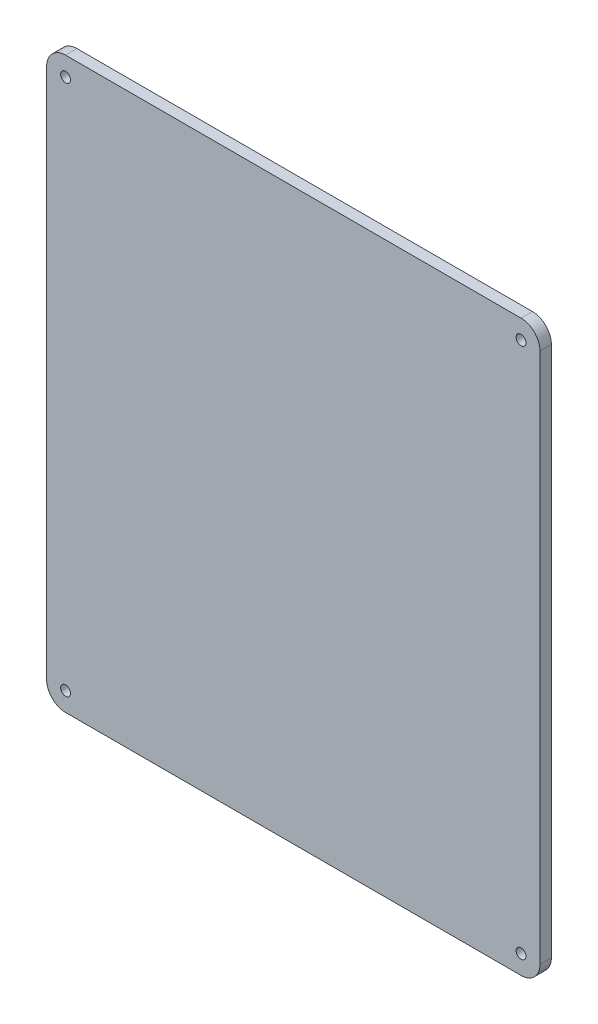
ISO-10303-21;
HEADER;
FILE_DESCRIPTION(('STEP AP214'),'2;1');
FILE_NAME('part.step','',(''),(''),'','','');
FILE_SCHEMA(('AUTOMOTIVE_DESIGN { 1 0 10303 214 1 1 1 1 }'));
ENDSEC;
DATA;
#1=APPLICATION_CONTEXT('core data for automotive mechanical design processes');
#2=APPLICATION_PROTOCOL_DEFINITION('international standard','automotive_design',2000,#1);
#3=PRODUCT_CONTEXT('',#1,'mechanical');
#4=PRODUCT('Part','Part','',(#3));
#5=PRODUCT_RELATED_PRODUCT_CATEGORY('part','',(#4));
#6=PRODUCT_DEFINITION_FORMATION('','',#4);
#7=PRODUCT_DEFINITION_CONTEXT('part definition',#1,'design');
#8=PRODUCT_DEFINITION('design','',#6,#7);
#9=PRODUCT_DEFINITION_SHAPE('','',#8);
#10=(LENGTH_UNIT() NAMED_UNIT(*) SI_UNIT(.MILLI.,.METRE.));
#11=(NAMED_UNIT(*) PLANE_ANGLE_UNIT() SI_UNIT($,.RADIAN.));
#12=(NAMED_UNIT(*) SI_UNIT($,.STERADIAN.) SOLID_ANGLE_UNIT());
#13=UNCERTAINTY_MEASURE_WITH_UNIT(LENGTH_MEASURE(1.E-05),#10,'distance_accuracy_value','');
#14=(GEOMETRIC_REPRESENTATION_CONTEXT(3) GLOBAL_UNCERTAINTY_ASSIGNED_CONTEXT((#13)) GLOBAL_UNIT_ASSIGNED_CONTEXT((#10,
#11,#12)) REPRESENTATION_CONTEXT('',''));
#15=CARTESIAN_POINT('',(0.,0.,0.));
#16=DIRECTION('',(0.,0.,1.));
#17=DIRECTION('',(1.,0.,0.));
#18=AXIS2_PLACEMENT_3D('',#15,#16,#17);
#19=CARTESIAN_POINT('',(-60.,-70.,3.));
#20=DIRECTION('',(0.,0.,-1.));
#21=DIRECTION('',(-1.,0.,0.));
#22=AXIS2_PLACEMENT_3D('',#19,#20,#21);
#23=CYLINDRICAL_SURFACE('',#22,5.);
#24=CARTESIAN_POINT('',(-60.,-70.,0.));
#25=DIRECTION('',(0.,0.,1.));
#26=DIRECTION('',(1.,0.,0.));
#27=AXIS2_PLACEMENT_3D('',#24,#25,#26);
#28=CIRCLE('',#27,5.);
#29=CARTESIAN_POINT('',(-65.,-70.,0.));
#30=VERTEX_POINT('',#29);
#31=CARTESIAN_POINT('',(-60.,-75.,0.));
#32=VERTEX_POINT('',#31);
#33=EDGE_CURVE('E129',#30,#32,#28,.T.);
#34=ORIENTED_EDGE('',*,*,#33,.T.);
#35=DIRECTION('',(0.,0.,-1.));
#36=VECTOR('',#35,1.);
#37=CARTESIAN_POINT('',(-60.,-75.,3.));
#38=LINE('',#37,#36);
#39=CARTESIAN_POINT('',(-60.,-75.,3.));
#40=VERTEX_POINT('',#39);
#41=EDGE_CURVE('E11',#40,#32,#38,.T.);
#42=ORIENTED_EDGE('',*,*,#41,.F.);
#43=CARTESIAN_POINT('',(-60.,-70.,3.));
#44=DIRECTION('',(0.,0.,1.));
#45=DIRECTION('',(1.,0.,0.));
#46=AXIS2_PLACEMENT_3D('',#43,#44,#45);
#47=CIRCLE('',#46,5.);
#48=CARTESIAN_POINT('',(-65.,-70.,3.));
#49=VERTEX_POINT('',#48);
#50=EDGE_CURVE('E144',#49,#40,#47,.T.);
#51=ORIENTED_EDGE('',*,*,#50,.F.);
#52=DIRECTION('',(0.,0.,-1.));
#53=VECTOR('',#52,1.);
#54=CARTESIAN_POINT('',(-65.,-70.,3.));
#55=LINE('',#54,#53);
#56=EDGE_CURVE('E125',#49,#30,#55,.T.);
#57=ORIENTED_EDGE('',*,*,#56,.T.);
#58=EDGE_LOOP('',(#34,#42,#51,#57));
#59=FACE_BOUND('',#58,.T.);
#60=ADVANCED_FACE('F33',(#59),#23,.T.);
#61=CARTESIAN_POINT('',(-60.,-75.,3.));
#62=DIRECTION('',(0.,1.,0.));
#63=DIRECTION('',(0.,0.,1.));
#64=AXIS2_PLACEMENT_3D('',#61,#62,#63);
#65=PLANE('',#64);
#66=DIRECTION('',(1.,0.,0.));
#67=VECTOR('',#66,1.);
#68=CARTESIAN_POINT('',(-60.,-75.,0.));
#69=LINE('',#68,#67);
#70=CARTESIAN_POINT('',(60.,-75.,0.));
#71=VERTEX_POINT('',#70);
#72=EDGE_CURVE('E132',#32,#71,#69,.T.);
#73=ORIENTED_EDGE('',*,*,#72,.T.);
#74=DIRECTION('',(0.,0.,-1.));
#75=VECTOR('',#74,1.);
#76=CARTESIAN_POINT('',(60.,-75.,3.));
#77=LINE('',#76,#75);
#78=CARTESIAN_POINT('',(60.,-75.,3.));
#79=VERTEX_POINT('',#78);
#80=EDGE_CURVE('E41',#79,#71,#77,.T.);
#81=ORIENTED_EDGE('',*,*,#80,.F.);
#82=DIRECTION('',(1.,0.,0.));
#83=VECTOR('',#82,1.);
#84=CARTESIAN_POINT('',(-60.,-75.,3.));
#85=LINE('',#84,#83);
#86=EDGE_CURVE('E92',#40,#79,#85,.T.);
#87=ORIENTED_EDGE('',*,*,#86,.F.);
#88=ORIENTED_EDGE('',*,*,#41,.T.);
#89=EDGE_LOOP('',(#73,#81,#87,#88));
#90=FACE_BOUND('',#89,.T.);
#91=ADVANCED_FACE('F229',(#90),#65,.F.);
#92=CARTESIAN_POINT('',(60.,-70.,3.));
#93=DIRECTION('',(0.,0.,-1.));
#94=DIRECTION('',(-1.,0.,0.));
#95=AXIS2_PLACEMENT_3D('',#92,#93,#94);
#96=CYLINDRICAL_SURFACE('',#95,5.);
#97=CARTESIAN_POINT('',(60.,-70.,0.));
#98=DIRECTION('',(0.,0.,1.));
#99=DIRECTION('',(1.,0.,0.));
#100=AXIS2_PLACEMENT_3D('',#97,#98,#99);
#101=CIRCLE('',#100,5.);
#102=CARTESIAN_POINT('',(65.,-70.,0.));
#103=VERTEX_POINT('',#102);
#104=EDGE_CURVE('E135',#71,#103,#101,.T.);
#105=ORIENTED_EDGE('',*,*,#104,.T.);
#106=DIRECTION('',(0.,0.,-1.));
#107=VECTOR('',#106,1.);
#108=CARTESIAN_POINT('',(65.,-70.,3.));
#109=LINE('',#108,#107);
#110=CARTESIAN_POINT('',(65.,-70.,3.));
#111=VERTEX_POINT('',#110);
#112=EDGE_CURVE('E151',#111,#103,#109,.T.);
#113=ORIENTED_EDGE('',*,*,#112,.F.);
#114=CARTESIAN_POINT('',(60.,-70.,3.));
#115=DIRECTION('',(0.,0.,1.));
#116=DIRECTION('',(1.,0.,0.));
#117=AXIS2_PLACEMENT_3D('',#114,#115,#116);
#118=CIRCLE('',#117,5.);
#119=EDGE_CURVE('E159',#79,#111,#118,.T.);
#120=ORIENTED_EDGE('',*,*,#119,.F.);
#121=ORIENTED_EDGE('',*,*,#80,.T.);
#122=EDGE_LOOP('',(#105,#113,#120,#121));
#123=FACE_BOUND('',#122,.T.);
#124=ADVANCED_FACE('F157',(#123),#96,.T.);
#125=CARTESIAN_POINT('',(65.,70.,3.));
#126=DIRECTION('',(-1.,0.,0.));
#127=DIRECTION('',(0.,-1.,0.));
#128=AXIS2_PLACEMENT_3D('',#125,#126,#127);
#129=PLANE('',#128);
#130=DIRECTION('',(0.,1.,0.));
#131=VECTOR('',#130,1.);
#132=CARTESIAN_POINT('',(65.,70.,0.));
#133=LINE('',#132,#131);
#134=CARTESIAN_POINT('',(65.,70.,0.));
#135=VERTEX_POINT('',#134);
#136=EDGE_CURVE('E137',#103,#135,#133,.T.);
#137=ORIENTED_EDGE('',*,*,#136,.T.);
#138=DIRECTION('',(0.,0.,-1.));
#139=VECTOR('',#138,1.);
#140=CARTESIAN_POINT('',(65.,70.,3.));
#141=LINE('',#140,#139);
#142=CARTESIAN_POINT('',(65.,70.,3.));
#143=VERTEX_POINT('',#142);
#144=EDGE_CURVE('E148',#143,#135,#141,.T.);
#145=ORIENTED_EDGE('',*,*,#144,.F.);
#146=DIRECTION('',(0.,1.,0.));
#147=VECTOR('',#146,1.);
#148=CARTESIAN_POINT('',(65.,70.,3.));
#149=LINE('',#148,#147);
#150=EDGE_CURVE('E171',#111,#143,#149,.T.);
#151=ORIENTED_EDGE('',*,*,#150,.F.);
#152=ORIENTED_EDGE('',*,*,#112,.T.);
#153=EDGE_LOOP('',(#137,#145,#151,#152));
#154=FACE_BOUND('',#153,.T.);
#155=ADVANCED_FACE('F167',(#154),#129,.F.);
#156=CARTESIAN_POINT('',(60.,70.,3.));
#157=DIRECTION('',(0.,0.,-1.));
#158=DIRECTION('',(-1.,0.,0.));
#159=AXIS2_PLACEMENT_3D('',#156,#157,#158);
#160=CYLINDRICAL_SURFACE('',#159,5.);
#161=CARTESIAN_POINT('',(60.,70.,0.));
#162=DIRECTION('',(0.,0.,1.));
#163=DIRECTION('',(1.,0.,0.));
#164=AXIS2_PLACEMENT_3D('',#161,#162,#163);
#165=CIRCLE('',#164,5.);
#166=CARTESIAN_POINT('',(60.,75.,0.));
#167=VERTEX_POINT('',#166);
#168=EDGE_CURVE('E139',#135,#167,#165,.T.);
#169=ORIENTED_EDGE('',*,*,#168,.T.);
#170=DIRECTION('',(0.,0.,-1.));
#171=VECTOR('',#170,1.);
#172=CARTESIAN_POINT('',(60.,75.,3.));
#173=LINE('',#172,#171);
#174=CARTESIAN_POINT('',(60.,75.,3.));
#175=VERTEX_POINT('',#174);
#176=EDGE_CURVE('E120',#175,#167,#173,.T.);
#177=ORIENTED_EDGE('',*,*,#176,.F.);
#178=CARTESIAN_POINT('',(60.,70.,3.));
#179=DIRECTION('',(0.,0.,1.));
#180=DIRECTION('',(1.,0.,0.));
#181=AXIS2_PLACEMENT_3D('',#178,#179,#180);
#182=CIRCLE('',#181,5.);
#183=EDGE_CURVE('E111',#143,#175,#182,.T.);
#184=ORIENTED_EDGE('',*,*,#183,.F.);
#185=ORIENTED_EDGE('',*,*,#144,.T.);
#186=EDGE_LOOP('',(#169,#177,#184,#185));
#187=FACE_BOUND('',#186,.T.);
#188=ADVANCED_FACE('F170',(#187),#160,.T.);
#189=CARTESIAN_POINT('',(-60.,75.,3.));
#190=DIRECTION('',(0.,-1.,0.));
#191=DIRECTION('',(0.,0.,-1.));
#192=AXIS2_PLACEMENT_3D('',#189,#190,#191);
#193=PLANE('',#192);
#194=DIRECTION('',(-1.,0.,0.));
#195=VECTOR('',#194,1.);
#196=CARTESIAN_POINT('',(-60.,75.,0.));
#197=LINE('',#196,#195);
#198=CARTESIAN_POINT('',(-60.,75.,0.));
#199=VERTEX_POINT('',#198);
#200=EDGE_CURVE('E119',#167,#199,#197,.T.);
#201=ORIENTED_EDGE('',*,*,#200,.T.);
#202=DIRECTION('',(0.,0.,-1.));
#203=VECTOR('',#202,1.);
#204=CARTESIAN_POINT('',(-60.,75.,3.));
#205=LINE('',#204,#203);
#206=CARTESIAN_POINT('',(-60.,75.,3.));
#207=VERTEX_POINT('',#206);
#208=EDGE_CURVE('E116',#207,#199,#205,.T.);
#209=ORIENTED_EDGE('',*,*,#208,.F.);
#210=DIRECTION('',(-1.,0.,0.));
#211=VECTOR('',#210,1.);
#212=CARTESIAN_POINT('',(-60.,75.,3.));
#213=LINE('',#212,#211);
#214=EDGE_CURVE('E105',#175,#207,#213,.T.);
#215=ORIENTED_EDGE('',*,*,#214,.F.);
#216=ORIENTED_EDGE('',*,*,#176,.T.);
#217=EDGE_LOOP('',(#201,#209,#215,#216));
#218=FACE_BOUND('',#217,.T.);
#219=ADVANCED_FACE('F117',(#218),#193,.F.);
#220=CARTESIAN_POINT('',(-60.,70.,3.));
#221=DIRECTION('',(0.,0.,-1.));
#222=DIRECTION('',(-1.,0.,0.));
#223=AXIS2_PLACEMENT_3D('',#220,#221,#222);
#224=CYLINDRICAL_SURFACE('',#223,5.);
#225=CARTESIAN_POINT('',(-60.,70.,0.));
#226=DIRECTION('',(0.,0.,1.));
#227=DIRECTION('',(-1.,0.,0.));
#228=AXIS2_PLACEMENT_3D('',#225,#226,#227);
#229=CIRCLE('',#228,5.);
#230=CARTESIAN_POINT('',(-65.,70.,0.));
#231=VERTEX_POINT('',#230);
#232=EDGE_CURVE('E78',#199,#231,#229,.T.);
#233=ORIENTED_EDGE('',*,*,#232,.T.);
#234=DIRECTION('',(0.,0.,-1.));
#235=VECTOR('',#234,1.);
#236=CARTESIAN_POINT('',(-65.,70.,3.));
#237=LINE('',#236,#235);
#238=CARTESIAN_POINT('',(-65.,70.,3.));
#239=VERTEX_POINT('',#238);
#240=EDGE_CURVE('E121',#239,#231,#237,.T.);
#241=ORIENTED_EDGE('',*,*,#240,.F.);
#242=CARTESIAN_POINT('',(-60.,70.,3.));
#243=DIRECTION('',(0.,0.,1.));
#244=DIRECTION('',(-1.,0.,0.));
#245=AXIS2_PLACEMENT_3D('',#242,#243,#244);
#246=CIRCLE('',#245,5.);
#247=EDGE_CURVE('E109',#207,#239,#246,.T.);
#248=ORIENTED_EDGE('',*,*,#247,.F.);
#249=ORIENTED_EDGE('',*,*,#208,.T.);
#250=EDGE_LOOP('',(#233,#241,#248,#249));
#251=FACE_BOUND('',#250,.T.);
#252=ADVANCED_FACE('F123',(#251),#224,.T.);
#253=CARTESIAN_POINT('',(-65.,70.,3.));
#254=DIRECTION('',(1.,0.,0.));
#255=DIRECTION('',(0.,1.,0.));
#256=AXIS2_PLACEMENT_3D('',#253,#254,#255);
#257=PLANE('',#256);
#258=DIRECTION('',(0.,-1.,0.));
#259=VECTOR('',#258,1.);
#260=CARTESIAN_POINT('',(-65.,70.,0.));
#261=LINE('',#260,#259);
#262=EDGE_CURVE('E84',#231,#30,#261,.T.);
#263=ORIENTED_EDGE('',*,*,#262,.T.);
#264=ORIENTED_EDGE('',*,*,#56,.F.);
#265=DIRECTION('',(0.,-1.,0.));
#266=VECTOR('',#265,1.);
#267=CARTESIAN_POINT('',(-65.,70.,3.));
#268=LINE('',#267,#266);
#269=EDGE_CURVE('E49',#239,#49,#268,.T.);
#270=ORIENTED_EDGE('',*,*,#269,.F.);
#271=ORIENTED_EDGE('',*,*,#240,.T.);
#272=EDGE_LOOP('',(#263,#264,#270,#271));
#273=FACE_BOUND('',#272,.T.);
#274=ADVANCED_FACE('F205',(#273),#257,.F.);
#275=CARTESIAN_POINT('',(-60.,-70.,3.));
#276=DIRECTION('',(0.,0.,1.));
#277=DIRECTION('',(1.,0.,0.));
#278=AXIS2_PLACEMENT_3D('',#275,#276,#277);
#279=PLANE('',#278);
#280=CARTESIAN_POINT('',(-60.,-70.,3.));
#281=DIRECTION('',(0.,0.,1.));
#282=DIRECTION('',(1.,0.,0.));
#283=AXIS2_PLACEMENT_3D('',#280,#281,#282);
#284=CIRCLE('',#283,1.3);
#285=CARTESIAN_POINT('',(-58.7,-70.,3.));
#286=VERTEX_POINT('',#285);
#287=EDGE_CURVE('E192',#286,#286,#284,.T.);
#288=ORIENTED_EDGE('',*,*,#287,.F.);
#289=EDGE_LOOP('',(#288));
#290=FACE_BOUND('',#289,.T.);
#291=CARTESIAN_POINT('',(60.,-70.,3.));
#292=DIRECTION('',(0.,0.,1.));
#293=DIRECTION('',(1.,0.,0.));
#294=AXIS2_PLACEMENT_3D('',#291,#292,#293);
#295=CIRCLE('',#294,1.3);
#296=CARTESIAN_POINT('',(61.3,-70.,3.));
#297=VERTEX_POINT('',#296);
#298=EDGE_CURVE('E186',#297,#297,#295,.T.);
#299=ORIENTED_EDGE('',*,*,#298,.F.);
#300=EDGE_LOOP('',(#299));
#301=FACE_BOUND('',#300,.T.);
#302=CARTESIAN_POINT('',(60.,70.,3.));
#303=DIRECTION('',(0.,0.,1.));
#304=DIRECTION('',(1.,0.,0.));
#305=AXIS2_PLACEMENT_3D('',#302,#303,#304);
#306=CIRCLE('',#305,1.3);
#307=CARTESIAN_POINT('',(61.3,70.,3.));
#308=VERTEX_POINT('',#307);
#309=EDGE_CURVE('E180',#308,#308,#306,.T.);
#310=ORIENTED_EDGE('',*,*,#309,.F.);
#311=EDGE_LOOP('',(#310));
#312=FACE_BOUND('',#311,.T.);
#313=CARTESIAN_POINT('',(-60.,70.,3.));
#314=DIRECTION('',(0.,0.,1.));
#315=DIRECTION('',(1.,0.,0.));
#316=AXIS2_PLACEMENT_3D('',#313,#314,#315);
#317=CIRCLE('',#316,1.3);
#318=CARTESIAN_POINT('',(-58.7,70.,3.));
#319=VERTEX_POINT('',#318);
#320=EDGE_CURVE('E177',#319,#319,#317,.T.);
#321=ORIENTED_EDGE('',*,*,#320,.F.);
#322=EDGE_LOOP('',(#321));
#323=FACE_BOUND('',#322,.T.);
#324=ORIENTED_EDGE('',*,*,#50,.T.);
#325=ORIENTED_EDGE('',*,*,#86,.T.);
#326=ORIENTED_EDGE('',*,*,#119,.T.);
#327=ORIENTED_EDGE('',*,*,#150,.T.);
#328=ORIENTED_EDGE('',*,*,#183,.T.);
#329=ORIENTED_EDGE('',*,*,#214,.T.);
#330=ORIENTED_EDGE('',*,*,#247,.T.);
#331=ORIENTED_EDGE('',*,*,#269,.T.);
#332=EDGE_LOOP('',(#324,#325,#326,#327,#328,#329,#330,#331));
#333=FACE_BOUND('',#332,.T.);
#334=ADVANCED_FACE('F107',(#290,#301,#312,#323,#333),#279,.T.);
#335=CARTESIAN_POINT('',(-60.,-70.,0.));
#336=DIRECTION('',(0.,0.,1.));
#337=DIRECTION('',(1.,0.,0.));
#338=AXIS2_PLACEMENT_3D('',#335,#336,#337);
#339=PLANE('',#338);
#340=CARTESIAN_POINT('',(-60.,-70.,0.));
#341=DIRECTION('',(0.,0.,1.));
#342=DIRECTION('',(1.,0.,0.));
#343=AXIS2_PLACEMENT_3D('',#340,#341,#342);
#344=CIRCLE('',#343,1.3);
#345=CARTESIAN_POINT('',(-58.7,-70.,0.));
#346=VERTEX_POINT('',#345);
#347=EDGE_CURVE('E195',#346,#346,#344,.T.);
#348=ORIENTED_EDGE('',*,*,#347,.T.);
#349=EDGE_LOOP('',(#348));
#350=FACE_BOUND('',#349,.T.);
#351=CARTESIAN_POINT('',(60.,-70.,0.));
#352=DIRECTION('',(0.,0.,1.));
#353=DIRECTION('',(1.,0.,0.));
#354=AXIS2_PLACEMENT_3D('',#351,#352,#353);
#355=CIRCLE('',#354,1.3);
#356=CARTESIAN_POINT('',(61.3,-70.,0.));
#357=VERTEX_POINT('',#356);
#358=EDGE_CURVE('E189',#357,#357,#355,.T.);
#359=ORIENTED_EDGE('',*,*,#358,.T.);
#360=EDGE_LOOP('',(#359));
#361=FACE_BOUND('',#360,.T.);
#362=CARTESIAN_POINT('',(60.,70.,0.));
#363=DIRECTION('',(0.,0.,1.));
#364=DIRECTION('',(1.,0.,0.));
#365=AXIS2_PLACEMENT_3D('',#362,#363,#364);
#366=CIRCLE('',#365,1.3);
#367=CARTESIAN_POINT('',(61.3,70.,0.));
#368=VERTEX_POINT('',#367);
#369=EDGE_CURVE('E183',#368,#368,#366,.T.);
#370=ORIENTED_EDGE('',*,*,#369,.T.);
#371=EDGE_LOOP('',(#370));
#372=FACE_BOUND('',#371,.T.);
#373=CARTESIAN_POINT('',(-60.,70.,0.));
#374=DIRECTION('',(0.,0.,1.));
#375=DIRECTION('',(1.,0.,0.));
#376=AXIS2_PLACEMENT_3D('',#373,#374,#375);
#377=CIRCLE('',#376,1.3);
#378=CARTESIAN_POINT('',(-58.7,70.,0.));
#379=VERTEX_POINT('',#378);
#380=EDGE_CURVE('E133',#379,#379,#377,.T.);
#381=ORIENTED_EDGE('',*,*,#380,.T.);
#382=EDGE_LOOP('',(#381));
#383=FACE_BOUND('',#382,.T.);
#384=ORIENTED_EDGE('',*,*,#33,.F.);
#385=ORIENTED_EDGE('',*,*,#262,.F.);
#386=ORIENTED_EDGE('',*,*,#232,.F.);
#387=ORIENTED_EDGE('',*,*,#200,.F.);
#388=ORIENTED_EDGE('',*,*,#168,.F.);
#389=ORIENTED_EDGE('',*,*,#136,.F.);
#390=ORIENTED_EDGE('',*,*,#104,.F.);
#391=ORIENTED_EDGE('',*,*,#72,.F.);
#392=EDGE_LOOP('',(#384,#385,#386,#387,#388,#389,#390,#391));
#393=FACE_BOUND('',#392,.T.);
#394=ADVANCED_FACE('F163',(#350,#361,#372,#383,#393),#339,.F.);
#395=CARTESIAN_POINT('',(-60.,70.,0.));
#396=DIRECTION('',(0.,0.,1.));
#397=DIRECTION('',(1.,0.,0.));
#398=AXIS2_PLACEMENT_3D('',#395,#396,#397);
#399=CYLINDRICAL_SURFACE('',#398,1.3);
#400=ORIENTED_EDGE('',*,*,#380,.F.);
#401=EDGE_LOOP('',(#400));
#402=FACE_BOUND('',#401,.T.);
#403=ORIENTED_EDGE('',*,*,#320,.T.);
#404=EDGE_LOOP('',(#403));
#405=FACE_BOUND('',#404,.T.);
#406=ADVANCED_FACE('F213',(#402,#405),#399,.F.);
#407=CARTESIAN_POINT('',(60.,70.,0.));
#408=DIRECTION('',(0.,0.,1.));
#409=DIRECTION('',(1.,0.,0.));
#410=AXIS2_PLACEMENT_3D('',#407,#408,#409);
#411=CYLINDRICAL_SURFACE('',#410,1.3);
#412=ORIENTED_EDGE('',*,*,#369,.F.);
#413=EDGE_LOOP('',(#412));
#414=FACE_BOUND('',#413,.T.);
#415=ORIENTED_EDGE('',*,*,#309,.T.);
#416=EDGE_LOOP('',(#415));
#417=FACE_BOUND('',#416,.T.);
#418=ADVANCED_FACE('F215',(#414,#417),#411,.F.);
#419=CARTESIAN_POINT('',(60.,-70.,0.));
#420=DIRECTION('',(0.,0.,1.));
#421=DIRECTION('',(1.,0.,0.));
#422=AXIS2_PLACEMENT_3D('',#419,#420,#421);
#423=CYLINDRICAL_SURFACE('',#422,1.3);
#424=ORIENTED_EDGE('',*,*,#358,.F.);
#425=EDGE_LOOP('',(#424));
#426=FACE_BOUND('',#425,.T.);
#427=ORIENTED_EDGE('',*,*,#298,.T.);
#428=EDGE_LOOP('',(#427));
#429=FACE_BOUND('',#428,.T.);
#430=ADVANCED_FACE('F222',(#426,#429),#423,.F.);
#431=CARTESIAN_POINT('',(-60.,-70.,0.));
#432=DIRECTION('',(0.,0.,1.));
#433=DIRECTION('',(1.,0.,0.));
#434=AXIS2_PLACEMENT_3D('',#431,#432,#433);
#435=CYLINDRICAL_SURFACE('',#434,1.3);
#436=ORIENTED_EDGE('',*,*,#347,.F.);
#437=EDGE_LOOP('',(#436));
#438=FACE_BOUND('',#437,.T.);
#439=ORIENTED_EDGE('',*,*,#287,.T.);
#440=EDGE_LOOP('',(#439));
#441=FACE_BOUND('',#440,.T.);
#442=ADVANCED_FACE('F201',(#438,#441),#435,.F.);
#443=CLOSED_SHELL('',(#60,#91,#124,#155,#188,#219,#252,#274,#334,#394,#406,#418,#430,#442));
#444=MANIFOLD_SOLID_BREP('B2',#443);
#445=ADVANCED_BREP_SHAPE_REPRESENTATION('',(#18,#444),#14);
#446=SHAPE_DEFINITION_REPRESENTATION(#9,#445);
ENDSEC;
END-ISO-10303-21;
